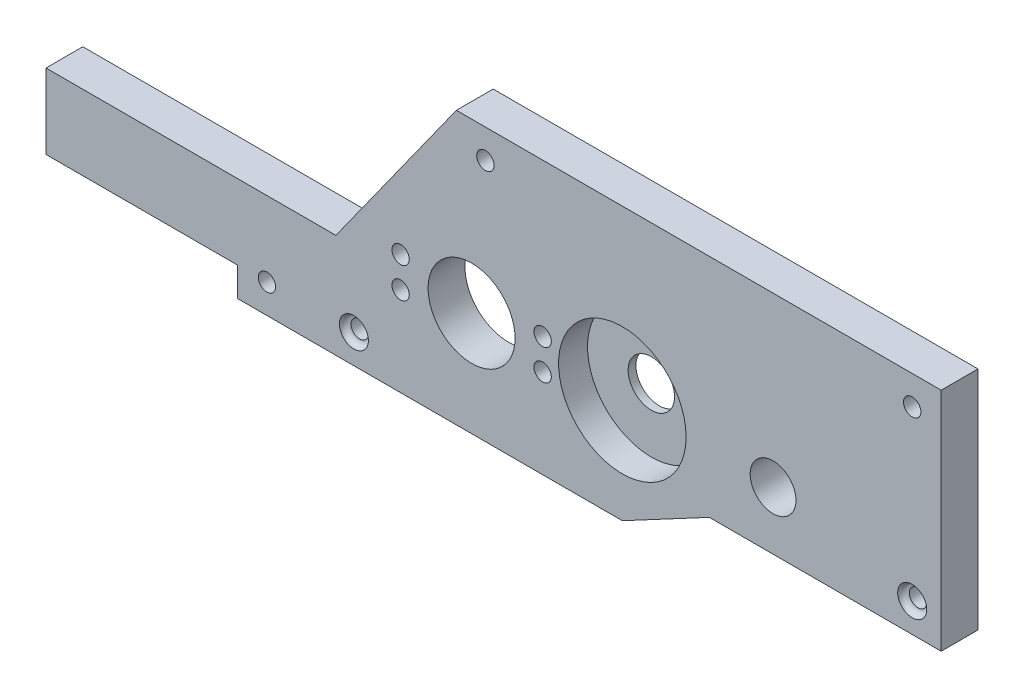
ISO-10303-21;
HEADER;
FILE_DESCRIPTION(('STEP AP214'),'2;1');
FILE_NAME('part.step','',(''),(''),'','','');
FILE_SCHEMA(('AUTOMOTIVE_DESIGN { 1 0 10303 214 1 1 1 1 }'));
ENDSEC;
DATA;
#1=APPLICATION_CONTEXT('core data for automotive mechanical design processes');
#2=APPLICATION_PROTOCOL_DEFINITION('international standard','automotive_design',2000,#1);
#3=PRODUCT_CONTEXT('',#1,'mechanical');
#4=PRODUCT('Part','Part','',(#3));
#5=PRODUCT_RELATED_PRODUCT_CATEGORY('part','',(#4));
#6=PRODUCT_DEFINITION_FORMATION('','',#4);
#7=PRODUCT_DEFINITION_CONTEXT('part definition',#1,'design');
#8=PRODUCT_DEFINITION('design','',#6,#7);
#9=PRODUCT_DEFINITION_SHAPE('','',#8);
#10=(LENGTH_UNIT() NAMED_UNIT(*) SI_UNIT(.MILLI.,.METRE.));
#11=(NAMED_UNIT(*) PLANE_ANGLE_UNIT() SI_UNIT($,.RADIAN.));
#12=(NAMED_UNIT(*) SI_UNIT($,.STERADIAN.) SOLID_ANGLE_UNIT());
#13=UNCERTAINTY_MEASURE_WITH_UNIT(LENGTH_MEASURE(1.E-05),#10,'distance_accuracy_value','');
#14=(GEOMETRIC_REPRESENTATION_CONTEXT(3) GLOBAL_UNCERTAINTY_ASSIGNED_CONTEXT((#13)) GLOBAL_UNIT_ASSIGNED_CONTEXT((#10,
#11,#12)) REPRESENTATION_CONTEXT('',''));
#15=CARTESIAN_POINT('',(0.,0.,0.));
#16=DIRECTION('',(0.,0.,1.));
#17=DIRECTION('',(1.,0.,0.));
#18=AXIS2_PLACEMENT_3D('',#15,#16,#17);
#19=CARTESIAN_POINT('',(0.,0.,6.35));
#20=DIRECTION('',(0.,0.,-1.));
#21=DIRECTION('',(-1.,0.,0.));
#22=AXIS2_PLACEMENT_3D('',#19,#20,#21);
#23=PLANE('',#22);
#24=CARTESIAN_POINT('',(6.02987029260401,-12.2207472610945,6.35));
#25=DIRECTION('',(0.,0.,-1.));
#26=DIRECTION('',(-1.,0.,0.));
#27=AXIS2_PLACEMENT_3D('',#24,#25,#26);
#28=CIRCLE('',#27,2.5);
#29=CARTESIAN_POINT('',(8.52987029260401,-12.2207472610945,6.35));
#30=VERTEX_POINT('',#29);
#31=EDGE_CURVE('E337',#30,#30,#28,.T.);
#32=ORIENTED_EDGE('',*,*,#31,.T.);
#33=EDGE_LOOP('',(#32));
#34=FACE_BOUND('',#33,.T.);
#35=CARTESIAN_POINT('',(102.331347664541,-4.22074726109447,6.35));
#36=DIRECTION('',(0.,0.,-1.));
#37=DIRECTION('',(-1.,0.,0.));
#38=AXIS2_PLACEMENT_3D('',#35,#36,#37);
#39=CIRCLE('',#38,2.5);
#40=CARTESIAN_POINT('',(104.831347664541,-4.22074726109447,6.35));
#41=VERTEX_POINT('',#40);
#42=EDGE_CURVE('E342',#41,#41,#39,.T.);
#43=ORIENTED_EDGE('',*,*,#42,.T.);
#44=EDGE_LOOP('',(#43));
#45=FACE_BOUND('',#44,.T.);
#46=CARTESIAN_POINT('',(52.331347664541,0.779252738905528,6.35));
#47=DIRECTION('',(0.,0.,1.));
#48=DIRECTION('',(1.,0.,0.));
#49=AXIS2_PLACEMENT_3D('',#46,#47,#48);
#50=CIRCLE('',#49,11.);
#51=CARTESIAN_POINT('',(63.331347664541,0.779252738905528,6.35));
#52=VERTEX_POINT('',#51);
#53=EDGE_CURVE('E349',#52,#52,#50,.T.);
#54=ORIENTED_EDGE('',*,*,#53,.F.);
#55=EDGE_LOOP('',(#54));
#56=FACE_BOUND('',#55,.T.);
#57=DIRECTION('',(-1.,0.,0.));
#58=VECTOR('',#57,1.);
#59=CARTESIAN_POINT('',(-47.0795340835919,-12.2207472610945,6.35));
#60=LINE('',#59,#58);
#61=CARTESIAN_POINT('',(-14.0795340835919,-12.2207472610945,6.35));
#62=VERTEX_POINT('',#61);
#63=CARTESIAN_POINT('',(-47.0795340835919,-12.2207472610945,6.35));
#64=VERTEX_POINT('',#63);
#65=EDGE_CURVE('E48',#62,#64,#60,.T.);
#66=ORIENTED_EDGE('',*,*,#65,.F.);
#67=DIRECTION('',(0.,1.,0.));
#68=VECTOR('',#67,1.);
#69=CARTESIAN_POINT('',(-14.0795340835919,-17.2207472610945,6.35));
#70=LINE('',#69,#68);
#71=CARTESIAN_POINT('',(-14.0795340835919,-17.2207472610945,6.35));
#72=VERTEX_POINT('',#71);
#73=EDGE_CURVE('E168',#72,#62,#70,.T.);
#74=ORIENTED_EDGE('',*,*,#73,.F.);
#75=DIRECTION('',(1.,0.,0.));
#76=VECTOR('',#75,1.);
#77=CARTESIAN_POINT('',(-47.0795340835919,-17.2207472610945,6.35));
#78=LINE('',#77,#76);
#79=CARTESIAN_POINT('',(52.3313476645411,-17.2207472610945,6.35));
#80=VERTEX_POINT('',#79);
#81=EDGE_CURVE('E174',#72,#80,#78,.T.);
#82=ORIENTED_EDGE('',*,*,#81,.T.);
#83=DIRECTION('',(0.882352941176471,0.470588235294117,0.));
#84=VECTOR('',#83,1.);
#85=CARTESIAN_POINT('',(52.3313476645411,-17.2207472610945,6.35));
#86=LINE('',#85,#84);
#87=CARTESIAN_POINT('',(67.3313476645411,-9.22074726109447,6.35));
#88=VERTEX_POINT('',#87);
#89=EDGE_CURVE('E177',#80,#88,#86,.T.);
#90=ORIENTED_EDGE('',*,*,#89,.T.);
#91=DIRECTION('',(1.,0.,0.));
#92=VECTOR('',#91,1.);
#93=CARTESIAN_POINT('',(67.3313476645411,-9.22074726109447,6.35));
#94=LINE('',#93,#92);
#95=CARTESIAN_POINT('',(107.331347664541,-9.22074726109447,6.35));
#96=VERTEX_POINT('',#95);
#97=EDGE_CURVE('E252',#88,#96,#94,.T.);
#98=ORIENTED_EDGE('',*,*,#97,.T.);
#99=DIRECTION('',(0.,1.,0.));
#100=VECTOR('',#99,1.);
#101=CARTESIAN_POINT('',(107.331347664541,29.7792527389055,6.35));
#102=LINE('',#101,#100);
#103=CARTESIAN_POINT('',(107.331347664541,29.7792527389055,6.35));
#104=VERTEX_POINT('',#103);
#105=EDGE_CURVE('E254',#96,#104,#102,.T.);
#106=ORIENTED_EDGE('',*,*,#105,.T.);
#107=DIRECTION('',(-1.,0.,0.));
#108=VECTOR('',#107,1.);
#109=CARTESIAN_POINT('',(107.331347664541,29.7792527389055,6.35));
#110=LINE('',#109,#108);
#111=CARTESIAN_POINT('',(23.7076239434154,29.7792527389055,6.35));
#112=VERTEX_POINT('',#111);
#113=EDGE_CURVE('E256',#104,#112,#110,.T.);
#114=ORIENTED_EDGE('',*,*,#113,.T.);
#115=DIRECTION('',(-0.581572960127056,-0.813494248319589,0.));
#116=VECTOR('',#115,1.);
#117=CARTESIAN_POINT('',(23.7076239434154,29.7792527389055,6.35));
#118=LINE('',#117,#116);
#119=CARTESIAN_POINT('',(2.9204659164081,0.70253381754017,6.35));
#120=VERTEX_POINT('',#119);
#121=EDGE_CURVE('E258',#112,#120,#118,.T.);
#122=ORIENTED_EDGE('',*,*,#121,.T.);
#123=DIRECTION('',(-1.,0.,0.));
#124=VECTOR('',#123,1.);
#125=CARTESIAN_POINT('',(2.9204659164081,0.70253381754017,6.35));
#126=LINE('',#125,#124);
#127=CARTESIAN_POINT('',(-47.0795340835919,0.702533817540142,6.35));
#128=VERTEX_POINT('',#127);
#129=EDGE_CURVE('E260',#120,#128,#126,.T.);
#130=ORIENTED_EDGE('',*,*,#129,.T.);
#131=DIRECTION('',(0.,-1.,0.));
#132=VECTOR('',#131,1.);
#133=CARTESIAN_POINT('',(-47.0795340835919,0.702533817540142,6.35));
#134=LINE('',#133,#132);
#135=EDGE_CURVE('E185',#128,#64,#134,.T.);
#136=ORIENTED_EDGE('',*,*,#135,.T.);
#137=EDGE_LOOP('',(#66,#74,#82,#90,#98,#106,#114,#122,#130,#136));
#138=FACE_BOUND('',#137,.T.);
#139=CARTESIAN_POINT('',(26.3313476645411,0.779252738905528,6.35));
#140=DIRECTION('',(0.,0.,1.));
#141=DIRECTION('',(1.,0.,0.));
#142=AXIS2_PLACEMENT_3D('',#139,#140,#141);
#143=CIRCLE('',#142,7.5);
#144=CARTESIAN_POINT('',(33.831347664541,0.779252738905528,6.35));
#145=VERTEX_POINT('',#144);
#146=EDGE_CURVE('E245',#145,#145,#143,.T.);
#147=ORIENTED_EDGE('',*,*,#146,.F.);
#148=EDGE_LOOP('',(#147));
#149=FACE_BOUND('',#148,.T.);
#150=CARTESIAN_POINT('',(38.581347664541,3.42925273890553,6.35));
#151=DIRECTION('',(0.,0.,1.));
#152=DIRECTION('',(1.,0.,0.));
#153=AXIS2_PLACEMENT_3D('',#150,#151,#152);
#154=CIRCLE('',#153,1.5);
#155=CARTESIAN_POINT('',(40.081347664541,3.42925273890553,6.35));
#156=VERTEX_POINT('',#155);
#157=EDGE_CURVE('E234',#156,#156,#154,.T.);
#158=ORIENTED_EDGE('',*,*,#157,.F.);
#159=EDGE_LOOP('',(#158));
#160=FACE_BOUND('',#159,.T.);
#161=CARTESIAN_POINT('',(38.581347664541,-1.87074726109447,6.35));
#162=DIRECTION('',(0.,0.,1.));
#163=DIRECTION('',(-1.,0.,0.));
#164=AXIS2_PLACEMENT_3D('',#161,#162,#163);
#165=CIRCLE('',#164,1.5);
#166=CARTESIAN_POINT('',(37.0813476645411,-1.87074726109447,6.35));
#167=VERTEX_POINT('',#166);
#168=EDGE_CURVE('E232',#167,#167,#165,.T.);
#169=ORIENTED_EDGE('',*,*,#168,.F.);
#170=EDGE_LOOP('',(#169));
#171=FACE_BOUND('',#170,.T.);
#172=CARTESIAN_POINT('',(14.0813476645411,-1.87074726109447,6.35));
#173=DIRECTION('',(0.,0.,1.));
#174=DIRECTION('',(1.,0.,0.));
#175=AXIS2_PLACEMENT_3D('',#172,#173,#174);
#176=CIRCLE('',#175,1.5);
#177=CARTESIAN_POINT('',(15.5813476645411,-1.87074726109447,6.35));
#178=VERTEX_POINT('',#177);
#179=EDGE_CURVE('E235',#178,#178,#176,.T.);
#180=ORIENTED_EDGE('',*,*,#179,.F.);
#181=EDGE_LOOP('',(#180));
#182=FACE_BOUND('',#181,.T.);
#183=CARTESIAN_POINT('',(14.0813476645411,3.42925273890553,6.35));
#184=DIRECTION('',(0.,0.,1.));
#185=DIRECTION('',(-1.,0.,0.));
#186=AXIS2_PLACEMENT_3D('',#183,#184,#185);
#187=CIRCLE('',#186,1.5);
#188=CARTESIAN_POINT('',(12.5813476645411,3.42925273890553,6.35));
#189=VERTEX_POINT('',#188);
#190=EDGE_CURVE('E241',#189,#189,#187,.T.);
#191=ORIENTED_EDGE('',*,*,#190,.F.);
#192=EDGE_LOOP('',(#191));
#193=FACE_BOUND('',#192,.T.);
#194=CARTESIAN_POINT('',(78.3313476645411,0.779252738905528,6.35));
#195=DIRECTION('',(0.,0.,1.));
#196=DIRECTION('',(1.,0.,0.));
#197=AXIS2_PLACEMENT_3D('',#194,#195,#196);
#198=CIRCLE('',#197,3.95);
#199=CARTESIAN_POINT('',(82.2813476645411,0.779252738905528,6.35));
#200=VERTEX_POINT('',#199);
#201=EDGE_CURVE('E379',#200,#200,#198,.T.);
#202=ORIENTED_EDGE('',*,*,#201,.F.);
#203=EDGE_LOOP('',(#202));
#204=FACE_BOUND('',#203,.T.);
#205=CARTESIAN_POINT('',(-8.97012970739599,-12.2207472610945,6.35));
#206=DIRECTION('',(0.,0.,1.));
#207=DIRECTION('',(1.,0.,0.));
#208=AXIS2_PLACEMENT_3D('',#205,#206,#207);
#209=CIRCLE('',#208,1.5);
#210=CARTESIAN_POINT('',(-7.47012970739599,-12.2207472610945,6.35));
#211=VERTEX_POINT('',#210);
#212=EDGE_CURVE('E373',#211,#211,#209,.T.);
#213=ORIENTED_EDGE('',*,*,#212,.F.);
#214=EDGE_LOOP('',(#213));
#215=FACE_BOUND('',#214,.T.);
#216=CARTESIAN_POINT('',(28.7076239434154,24.7792527389055,6.35));
#217=DIRECTION('',(0.,0.,1.));
#218=DIRECTION('',(1.,0.,0.));
#219=AXIS2_PLACEMENT_3D('',#216,#217,#218);
#220=CIRCLE('',#219,1.5);
#221=CARTESIAN_POINT('',(30.2076239434154,24.7792527389055,6.35));
#222=VERTEX_POINT('',#221);
#223=EDGE_CURVE('E364',#222,#222,#220,.T.);
#224=ORIENTED_EDGE('',*,*,#223,.F.);
#225=EDGE_LOOP('',(#224));
#226=FACE_BOUND('',#225,.T.);
#227=CARTESIAN_POINT('',(102.331347664541,24.7792527389055,6.35));
#228=DIRECTION('',(0.,0.,1.));
#229=DIRECTION('',(1.,0.,0.));
#230=AXIS2_PLACEMENT_3D('',#227,#228,#229);
#231=CIRCLE('',#230,1.5);
#232=CARTESIAN_POINT('',(103.831347664541,24.7792527389055,6.35));
#233=VERTEX_POINT('',#232);
#234=EDGE_CURVE('E361',#233,#233,#231,.T.);
#235=ORIENTED_EDGE('',*,*,#234,.F.);
#236=EDGE_LOOP('',(#235));
#237=FACE_BOUND('',#236,.T.);
#238=ADVANCED_FACE('F33',(#34,#45,#56,#138,#149,#160,#171,#182,#193,#204,#215,#226,#237),#23,.F.);
#239=CARTESIAN_POINT('',(0.,0.,0.));
#240=DIRECTION('',(0.,0.,-1.));
#241=DIRECTION('',(-1.,0.,0.));
#242=AXIS2_PLACEMENT_3D('',#239,#240,#241);
#243=PLANE('',#242);
#244=DIRECTION('',(0.,-1.,0.));
#245=VECTOR('',#244,1.);
#246=CARTESIAN_POINT('',(-14.0795340835919,-17.2207472610945,0.));
#247=LINE('',#246,#245);
#248=CARTESIAN_POINT('',(-14.0795340835919,-12.2207472610945,0.));
#249=VERTEX_POINT('',#248);
#250=CARTESIAN_POINT('',(-14.0795340835919,-17.2207472610945,0.));
#251=VERTEX_POINT('',#250);
#252=EDGE_CURVE('E159',#249,#251,#247,.T.);
#253=ORIENTED_EDGE('',*,*,#252,.F.);
#254=DIRECTION('',(1.,0.,0.));
#255=VECTOR('',#254,1.);
#256=CARTESIAN_POINT('',(-47.0795340835919,-12.2207472610945,0.));
#257=LINE('',#256,#255);
#258=CARTESIAN_POINT('',(-47.0795340835919,-12.2207472610945,0.));
#259=VERTEX_POINT('',#258);
#260=EDGE_CURVE('E152',#259,#249,#257,.T.);
#261=ORIENTED_EDGE('',*,*,#260,.F.);
#262=DIRECTION('',(0.,-1.,0.));
#263=VECTOR('',#262,1.);
#264=CARTESIAN_POINT('',(-47.0795340835919,0.702533817540142,0.));
#265=LINE('',#264,#263);
#266=CARTESIAN_POINT('',(-47.0795340835919,0.702533817540142,0.));
#267=VERTEX_POINT('',#266);
#268=EDGE_CURVE('E166',#267,#259,#265,.T.);
#269=ORIENTED_EDGE('',*,*,#268,.F.);
#270=DIRECTION('',(-1.,0.,0.));
#271=VECTOR('',#270,1.);
#272=CARTESIAN_POINT('',(2.9204659164081,0.70253381754017,0.));
#273=LINE('',#272,#271);
#274=CARTESIAN_POINT('',(2.9204659164081,0.70253381754017,0.));
#275=VERTEX_POINT('',#274);
#276=EDGE_CURVE('E175',#275,#267,#273,.T.);
#277=ORIENTED_EDGE('',*,*,#276,.F.);
#278=DIRECTION('',(-0.581572960127056,-0.813494248319589,0.));
#279=VECTOR('',#278,1.);
#280=CARTESIAN_POINT('',(23.7076239434154,29.7792527389055,0.));
#281=LINE('',#280,#279);
#282=CARTESIAN_POINT('',(23.7076239434154,29.7792527389055,0.));
#283=VERTEX_POINT('',#282);
#284=EDGE_CURVE('E179',#283,#275,#281,.T.);
#285=ORIENTED_EDGE('',*,*,#284,.F.);
#286=DIRECTION('',(-1.,0.,0.));
#287=VECTOR('',#286,1.);
#288=CARTESIAN_POINT('',(107.331347664541,29.7792527389055,0.));
#289=LINE('',#288,#287);
#290=CARTESIAN_POINT('',(107.331347664541,29.7792527389055,0.));
#291=VERTEX_POINT('',#290);
#292=EDGE_CURVE('E270',#291,#283,#289,.T.);
#293=ORIENTED_EDGE('',*,*,#292,.F.);
#294=DIRECTION('',(0.,1.,0.));
#295=VECTOR('',#294,1.);
#296=CARTESIAN_POINT('',(107.331347664541,29.7792527389055,0.));
#297=LINE('',#296,#295);
#298=CARTESIAN_POINT('',(107.331347664541,-9.22074726109447,0.));
#299=VERTEX_POINT('',#298);
#300=EDGE_CURVE('E268',#299,#291,#297,.T.);
#301=ORIENTED_EDGE('',*,*,#300,.F.);
#302=DIRECTION('',(1.,0.,0.));
#303=VECTOR('',#302,1.);
#304=CARTESIAN_POINT('',(67.3313476645411,-9.22074726109447,0.));
#305=LINE('',#304,#303);
#306=CARTESIAN_POINT('',(67.3313476645411,-9.22074726109447,0.));
#307=VERTEX_POINT('',#306);
#308=EDGE_CURVE('E266',#307,#299,#305,.T.);
#309=ORIENTED_EDGE('',*,*,#308,.F.);
#310=DIRECTION('',(0.882352941176471,0.470588235294117,0.));
#311=VECTOR('',#310,1.);
#312=CARTESIAN_POINT('',(52.3313476645411,-17.2207472610945,0.));
#313=LINE('',#312,#311);
#314=CARTESIAN_POINT('',(52.3313476645411,-17.2207472610945,0.));
#315=VERTEX_POINT('',#314);
#316=EDGE_CURVE('E264',#315,#307,#313,.T.);
#317=ORIENTED_EDGE('',*,*,#316,.F.);
#318=DIRECTION('',(1.,0.,0.));
#319=VECTOR('',#318,1.);
#320=CARTESIAN_POINT('',(26.3313476645411,-17.2207472610945,0.));
#321=LINE('',#320,#319);
#322=EDGE_CURVE('E248',#251,#315,#321,.T.);
#323=ORIENTED_EDGE('',*,*,#322,.F.);
#324=EDGE_LOOP('',(#253,#261,#269,#277,#285,#293,#301,#309,#317,#323));
#325=FACE_BOUND('',#324,.T.);
#326=CARTESIAN_POINT('',(28.7076239434154,24.7792527389055,0.));
#327=DIRECTION('',(0.,0.,-1.));
#328=DIRECTION('',(-1.,0.,0.));
#329=AXIS2_PLACEMENT_3D('',#326,#327,#328);
#330=CIRCLE('',#329,2.5);
#331=CARTESIAN_POINT('',(31.2076239434154,24.7792527389055,0.));
#332=VERTEX_POINT('',#331);
#333=EDGE_CURVE('E315',#332,#332,#330,.T.);
#334=ORIENTED_EDGE('',*,*,#333,.F.);
#335=EDGE_LOOP('',(#334));
#336=FACE_BOUND('',#335,.T.);
#337=CARTESIAN_POINT('',(38.581347664541,-1.87074726109447,0.));
#338=DIRECTION('',(0.,0.,-1.));
#339=DIRECTION('',(-1.,0.,0.));
#340=AXIS2_PLACEMENT_3D('',#337,#338,#339);
#341=CIRCLE('',#340,2.5);
#342=CARTESIAN_POINT('',(36.0813476645411,-1.87074726109447,0.));
#343=VERTEX_POINT('',#342);
#344=EDGE_CURVE('E318',#343,#343,#341,.T.);
#345=ORIENTED_EDGE('',*,*,#344,.F.);
#346=EDGE_LOOP('',(#345));
#347=FACE_BOUND('',#346,.T.);
#348=CARTESIAN_POINT('',(38.581347664541,3.42925273890553,0.));
#349=DIRECTION('',(0.,0.,-1.));
#350=DIRECTION('',(-1.,0.,0.));
#351=AXIS2_PLACEMENT_3D('',#348,#349,#350);
#352=CIRCLE('',#351,2.5);
#353=CARTESIAN_POINT('',(41.081347664541,3.42925273890553,0.));
#354=VERTEX_POINT('',#353);
#355=EDGE_CURVE('E322',#354,#354,#352,.T.);
#356=ORIENTED_EDGE('',*,*,#355,.F.);
#357=EDGE_LOOP('',(#356));
#358=FACE_BOUND('',#357,.T.);
#359=CARTESIAN_POINT('',(14.0813476645411,-1.87074726109447,0.));
#360=DIRECTION('',(0.,0.,-1.));
#361=DIRECTION('',(-1.,0.,0.));
#362=AXIS2_PLACEMENT_3D('',#359,#360,#361);
#363=CIRCLE('',#362,2.5);
#364=CARTESIAN_POINT('',(16.5813476645411,-1.87074726109447,0.));
#365=VERTEX_POINT('',#364);
#366=EDGE_CURVE('E327',#365,#365,#363,.T.);
#367=ORIENTED_EDGE('',*,*,#366,.F.);
#368=EDGE_LOOP('',(#367));
#369=FACE_BOUND('',#368,.T.);
#370=CARTESIAN_POINT('',(14.0813476645411,3.42925273890553,0.));
#371=DIRECTION('',(0.,0.,-1.));
#372=DIRECTION('',(-1.,0.,0.));
#373=AXIS2_PLACEMENT_3D('',#370,#371,#372);
#374=CIRCLE('',#373,2.5);
#375=CARTESIAN_POINT('',(11.581347664541,3.42925273890553,0.));
#376=VERTEX_POINT('',#375);
#377=EDGE_CURVE('E332',#376,#376,#374,.T.);
#378=ORIENTED_EDGE('',*,*,#377,.F.);
#379=EDGE_LOOP('',(#378));
#380=FACE_BOUND('',#379,.T.);
#381=CARTESIAN_POINT('',(52.331347664541,0.779252738905528,0.));
#382=DIRECTION('',(0.,0.,-1.));
#383=DIRECTION('',(-1.,0.,0.));
#384=AXIS2_PLACEMENT_3D('',#381,#382,#383);
#385=CIRCLE('',#384,4.00000000000001);
#386=CARTESIAN_POINT('',(48.331347664541,0.779252738905528,0.));
#387=VERTEX_POINT('',#386);
#388=EDGE_CURVE('E345',#387,#387,#385,.F.);
#389=ORIENTED_EDGE('',*,*,#388,.T.);
#390=EDGE_LOOP('',(#389));
#391=FACE_BOUND('',#390,.T.);
#392=CARTESIAN_POINT('',(102.331347664541,24.7792527389055,0.));
#393=DIRECTION('',(0.,0.,1.));
#394=DIRECTION('',(1.,0.,0.));
#395=AXIS2_PLACEMENT_3D('',#392,#393,#394);
#396=CIRCLE('',#395,1.5);
#397=CARTESIAN_POINT('',(103.831347664541,24.7792527389055,0.));
#398=VERTEX_POINT('',#397);
#399=EDGE_CURVE('E360',#398,#398,#396,.T.);
#400=ORIENTED_EDGE('',*,*,#399,.T.);
#401=EDGE_LOOP('',(#400));
#402=FACE_BOUND('',#401,.T.);
#403=CARTESIAN_POINT('',(6.02987029260401,-12.2207472610945,0.));
#404=DIRECTION('',(0.,0.,1.));
#405=DIRECTION('',(1.,0.,0.));
#406=AXIS2_PLACEMENT_3D('',#403,#404,#405);
#407=CIRCLE('',#406,1.5);
#408=CARTESIAN_POINT('',(7.52987029260401,-12.2207472610945,0.));
#409=VERTEX_POINT('',#408);
#410=EDGE_CURVE('E369',#409,#409,#407,.T.);
#411=ORIENTED_EDGE('',*,*,#410,.T.);
#412=EDGE_LOOP('',(#411));
#413=FACE_BOUND('',#412,.T.);
#414=CARTESIAN_POINT('',(78.3313476645411,0.779252738905528,0.));
#415=DIRECTION('',(0.,0.,1.));
#416=DIRECTION('',(1.,0.,0.));
#417=AXIS2_PLACEMENT_3D('',#414,#415,#416);
#418=CIRCLE('',#417,3.95);
#419=CARTESIAN_POINT('',(82.2813476645411,0.779252738905528,0.));
#420=VERTEX_POINT('',#419);
#421=EDGE_CURVE('E376',#420,#420,#418,.T.);
#422=ORIENTED_EDGE('',*,*,#421,.T.);
#423=EDGE_LOOP('',(#422));
#424=FACE_BOUND('',#423,.T.);
#425=CARTESIAN_POINT('',(26.3313476645411,0.779252738905528,0.));
#426=DIRECTION('',(0.,0.,1.));
#427=DIRECTION('',(1.,0.,0.));
#428=AXIS2_PLACEMENT_3D('',#425,#426,#427);
#429=CIRCLE('',#428,7.5);
#430=CARTESIAN_POINT('',(33.831347664541,0.779252738905528,0.));
#431=VERTEX_POINT('',#430);
#432=EDGE_CURVE('E238',#431,#431,#429,.T.);
#433=ORIENTED_EDGE('',*,*,#432,.T.);
#434=EDGE_LOOP('',(#433));
#435=FACE_BOUND('',#434,.T.);
#436=CARTESIAN_POINT('',(-8.97012970739599,-12.2207472610945,0.));
#437=DIRECTION('',(0.,0.,1.));
#438=DIRECTION('',(1.,0.,0.));
#439=AXIS2_PLACEMENT_3D('',#436,#437,#438);
#440=CIRCLE('',#439,1.5);
#441=CARTESIAN_POINT('',(-7.47012970739599,-12.2207472610945,0.));
#442=VERTEX_POINT('',#441);
#443=EDGE_CURVE('E372',#442,#442,#440,.T.);
#444=ORIENTED_EDGE('',*,*,#443,.T.);
#445=EDGE_LOOP('',(#444));
#446=FACE_BOUND('',#445,.T.);
#447=CARTESIAN_POINT('',(102.331347664541,-4.22074726109447,0.));
#448=DIRECTION('',(0.,0.,1.));
#449=DIRECTION('',(1.,0.,0.));
#450=AXIS2_PLACEMENT_3D('',#447,#448,#449);
#451=CIRCLE('',#450,1.5);
#452=CARTESIAN_POINT('',(103.831347664541,-4.22074726109447,0.));
#453=VERTEX_POINT('',#452);
#454=EDGE_CURVE('E355',#453,#453,#451,.T.);
#455=ORIENTED_EDGE('',*,*,#454,.T.);
#456=EDGE_LOOP('',(#455));
#457=FACE_BOUND('',#456,.T.);
#458=ADVANCED_FACE('F163',(#325,#336,#347,#358,#369,#380,#391,#402,#413,#424,#435,#446,#457),
#243,.T.);
#459=CARTESIAN_POINT('',(26.3313476645411,-17.2207472610945,6.35));
#460=DIRECTION('',(0.,1.,0.));
#461=DIRECTION('',(-1.,0.,0.));
#462=AXIS2_PLACEMENT_3D('',#459,#460,#461);
#463=PLANE('',#462);
#464=ORIENTED_EDGE('',*,*,#81,.F.);
#465=DIRECTION('',(0.,0.,-1.));
#466=VECTOR('',#465,1.);
#467=CARTESIAN_POINT('',(-14.0795340835919,-17.2207472610945,6.351));
#468=LINE('',#467,#466);
#469=EDGE_CURVE('E305',#72,#251,#468,.T.);
#470=ORIENTED_EDGE('',*,*,#469,.T.);
#471=ORIENTED_EDGE('',*,*,#322,.T.);
#472=DIRECTION('',(0.,0.,-1.));
#473=VECTOR('',#472,1.);
#474=CARTESIAN_POINT('',(52.3313476645411,-17.2207472610945,6.35));
#475=LINE('',#474,#473);
#476=EDGE_CURVE('E200',#80,#315,#475,.T.);
#477=ORIENTED_EDGE('',*,*,#476,.F.);
#478=EDGE_LOOP('',(#464,#470,#471,#477));
#479=FACE_BOUND('',#478,.T.);
#480=ADVANCED_FACE('F35',(#479),#463,.F.);
#481=CARTESIAN_POINT('',(52.3313476645411,-17.2207472610945,6.35));
#482=DIRECTION('',(-0.470588235294117,0.882352941176471,0.));
#483=DIRECTION('',(-0.882352941176471,-0.470588235294117,0.));
#484=AXIS2_PLACEMENT_3D('',#481,#482,#483);
#485=PLANE('',#484);
#486=ORIENTED_EDGE('',*,*,#316,.T.);
#487=DIRECTION('',(0.,0.,-1.));
#488=VECTOR('',#487,1.);
#489=CARTESIAN_POINT('',(67.3313476645411,-9.22074726109447,6.35));
#490=LINE('',#489,#488);
#491=EDGE_CURVE('E197',#88,#307,#490,.T.);
#492=ORIENTED_EDGE('',*,*,#491,.F.);
#493=ORIENTED_EDGE('',*,*,#89,.F.);
#494=ORIENTED_EDGE('',*,*,#476,.T.);
#495=EDGE_LOOP('',(#486,#492,#493,#494));
#496=FACE_BOUND('',#495,.T.);
#497=ADVANCED_FACE('F300',(#496),#485,.F.);
#498=CARTESIAN_POINT('',(67.3313476645411,-9.22074726109447,6.35));
#499=DIRECTION('',(0.,1.,0.));
#500=DIRECTION('',(0.,0.,1.));
#501=AXIS2_PLACEMENT_3D('',#498,#499,#500);
#502=PLANE('',#501);
#503=ORIENTED_EDGE('',*,*,#308,.T.);
#504=DIRECTION('',(0.,0.,-1.));
#505=VECTOR('',#504,1.);
#506=CARTESIAN_POINT('',(107.331347664541,-9.22074726109447,6.35));
#507=LINE('',#506,#505);
#508=EDGE_CURVE('E194',#96,#299,#507,.T.);
#509=ORIENTED_EDGE('',*,*,#508,.F.);
#510=ORIENTED_EDGE('',*,*,#97,.F.);
#511=ORIENTED_EDGE('',*,*,#491,.T.);
#512=EDGE_LOOP('',(#503,#509,#510,#511));
#513=FACE_BOUND('',#512,.T.);
#514=ADVANCED_FACE('F296',(#513),#502,.F.);
#515=CARTESIAN_POINT('',(107.331347664541,29.7792527389055,6.35));
#516=DIRECTION('',(-1.,0.,0.));
#517=DIRECTION('',(0.,-1.,0.));
#518=AXIS2_PLACEMENT_3D('',#515,#516,#517);
#519=PLANE('',#518);
#520=ORIENTED_EDGE('',*,*,#300,.T.);
#521=DIRECTION('',(0.,0.,-1.));
#522=VECTOR('',#521,1.);
#523=CARTESIAN_POINT('',(107.331347664541,29.7792527389055,6.35));
#524=LINE('',#523,#522);
#525=EDGE_CURVE('E191',#104,#291,#524,.T.);
#526=ORIENTED_EDGE('',*,*,#525,.F.);
#527=ORIENTED_EDGE('',*,*,#105,.F.);
#528=ORIENTED_EDGE('',*,*,#508,.T.);
#529=EDGE_LOOP('',(#520,#526,#527,#528));
#530=FACE_BOUND('',#529,.T.);
#531=ADVANCED_FACE('F292',(#530),#519,.F.);
#532=CARTESIAN_POINT('',(107.331347664541,29.7792527389055,6.35));
#533=DIRECTION('',(0.,-1.,0.));
#534=DIRECTION('',(1.,0.,0.));
#535=AXIS2_PLACEMENT_3D('',#532,#533,#534);
#536=PLANE('',#535);
#537=ORIENTED_EDGE('',*,*,#292,.T.);
#538=DIRECTION('',(0.,0.,-1.));
#539=VECTOR('',#538,1.);
#540=CARTESIAN_POINT('',(23.7076239434154,29.7792527389055,6.35));
#541=LINE('',#540,#539);
#542=EDGE_CURVE('E188',#112,#283,#541,.T.);
#543=ORIENTED_EDGE('',*,*,#542,.F.);
#544=ORIENTED_EDGE('',*,*,#113,.F.);
#545=ORIENTED_EDGE('',*,*,#525,.T.);
#546=EDGE_LOOP('',(#537,#543,#544,#545));
#547=FACE_BOUND('',#546,.T.);
#548=ADVANCED_FACE('F287',(#547),#536,.F.);
#549=CARTESIAN_POINT('',(23.7076239434154,29.7792527389055,6.35));
#550=DIRECTION('',(0.813494248319589,-0.581572960127056,0.));
#551=DIRECTION('',(0.581572960127056,0.81349424831959,0.));
#552=AXIS2_PLACEMENT_3D('',#549,#550,#551);
#553=PLANE('',#552);
#554=ORIENTED_EDGE('',*,*,#284,.T.);
#555=DIRECTION('',(0.,0.,-1.));
#556=VECTOR('',#555,1.);
#557=CARTESIAN_POINT('',(2.9204659164081,0.70253381754017,6.35));
#558=LINE('',#557,#556);
#559=EDGE_CURVE('E184',#120,#275,#558,.T.);
#560=ORIENTED_EDGE('',*,*,#559,.F.);
#561=ORIENTED_EDGE('',*,*,#121,.F.);
#562=ORIENTED_EDGE('',*,*,#542,.T.);
#563=EDGE_LOOP('',(#554,#560,#561,#562));
#564=FACE_BOUND('',#563,.T.);
#565=ADVANCED_FACE('F274',(#564),#553,.F.);
#566=CARTESIAN_POINT('',(2.9204659164081,0.70253381754017,6.35));
#567=DIRECTION('',(0.,-1.,0.));
#568=DIRECTION('',(1.,0.,0.));
#569=AXIS2_PLACEMENT_3D('',#566,#567,#568);
#570=PLANE('',#569);
#571=ORIENTED_EDGE('',*,*,#276,.T.);
#572=DIRECTION('',(0.,0.,-1.));
#573=VECTOR('',#572,1.);
#574=CARTESIAN_POINT('',(-47.0795340835919,0.702533817540142,6.35));
#575=LINE('',#574,#573);
#576=EDGE_CURVE('E173',#128,#267,#575,.T.);
#577=ORIENTED_EDGE('',*,*,#576,.F.);
#578=ORIENTED_EDGE('',*,*,#129,.F.);
#579=ORIENTED_EDGE('',*,*,#559,.T.);
#580=EDGE_LOOP('',(#571,#577,#578,#579));
#581=FACE_BOUND('',#580,.T.);
#582=ADVANCED_FACE('F280',(#581),#570,.F.);
#583=CARTESIAN_POINT('',(-47.0795340835919,0.702533817540142,6.35));
#584=DIRECTION('',(1.,0.,0.));
#585=DIRECTION('',(0.,0.,-1.));
#586=AXIS2_PLACEMENT_3D('',#583,#584,#585);
#587=PLANE('',#586);
#588=ORIENTED_EDGE('',*,*,#268,.T.);
#589=DIRECTION('',(0.,0.,-1.));
#590=VECTOR('',#589,1.);
#591=CARTESIAN_POINT('',(-47.0795340835919,-12.2207472610945,6.351));
#592=LINE('',#591,#590);
#593=EDGE_CURVE('E149',#64,#259,#592,.T.);
#594=ORIENTED_EDGE('',*,*,#593,.F.);
#595=ORIENTED_EDGE('',*,*,#135,.F.);
#596=ORIENTED_EDGE('',*,*,#576,.T.);
#597=EDGE_LOOP('',(#588,#594,#595,#596));
#598=FACE_BOUND('',#597,.T.);
#599=ADVANCED_FACE('F171',(#598),#587,.F.);
#600=CARTESIAN_POINT('',(26.3313476645411,0.779252738905528,6.35));
#601=DIRECTION('',(0.,0.,-1.));
#602=DIRECTION('',(-1.,0.,0.));
#603=AXIS2_PLACEMENT_3D('',#600,#601,#602);
#604=CYLINDRICAL_SURFACE('',#603,7.5);
#605=ORIENTED_EDGE('',*,*,#146,.T.);
#606=EDGE_LOOP('',(#605));
#607=FACE_BOUND('',#606,.T.);
#608=ORIENTED_EDGE('',*,*,#432,.F.);
#609=EDGE_LOOP('',(#608));
#610=FACE_BOUND('',#609,.T.);
#611=ADVANCED_FACE('F457',(#607,#610),#604,.F.);
#612=CARTESIAN_POINT('',(38.581347664541,3.42925273890553,6.35));
#613=DIRECTION('',(0.,0.,-1.));
#614=DIRECTION('',(-1.,0.,0.));
#615=AXIS2_PLACEMENT_3D('',#612,#613,#614);
#616=CYLINDRICAL_SURFACE('',#615,1.5);
#617=CARTESIAN_POINT('',(38.581347664541,3.42925273890553,1.));
#618=DIRECTION('',(0.,0.,-1.));
#619=DIRECTION('',(-1.,0.,0.));
#620=AXIS2_PLACEMENT_3D('',#617,#618,#619);
#621=CIRCLE('',#620,1.5);
#622=CARTESIAN_POINT('',(40.081347664541,3.42925273890553,1.));
#623=VERTEX_POINT('',#622);
#624=EDGE_CURVE('E215',#623,#623,#621,.F.);
#625=ORIENTED_EDGE('',*,*,#624,.F.);
#626=EDGE_LOOP('',(#625));
#627=FACE_BOUND('',#626,.T.);
#628=ORIENTED_EDGE('',*,*,#157,.T.);
#629=EDGE_LOOP('',(#628));
#630=FACE_BOUND('',#629,.T.);
#631=ADVANCED_FACE('F228',(#627,#630),#616,.F.);
#632=CARTESIAN_POINT('',(38.581347664541,-1.87074726109447,6.35));
#633=DIRECTION('',(0.,0.,-1.));
#634=DIRECTION('',(-1.,0.,0.));
#635=AXIS2_PLACEMENT_3D('',#632,#633,#634);
#636=CYLINDRICAL_SURFACE('',#635,1.5);
#637=CARTESIAN_POINT('',(38.581347664541,-1.87074726109447,1.));
#638=DIRECTION('',(0.,0.,-1.));
#639=DIRECTION('',(-1.,0.,0.));
#640=AXIS2_PLACEMENT_3D('',#637,#638,#639);
#641=CIRCLE('',#640,1.5);
#642=CARTESIAN_POINT('',(37.0813476645411,-1.87074726109447,1.));
#643=VERTEX_POINT('',#642);
#644=EDGE_CURVE('E41',#643,#643,#641,.F.);
#645=ORIENTED_EDGE('',*,*,#644,.F.);
#646=EDGE_LOOP('',(#645));
#647=FACE_BOUND('',#646,.T.);
#648=ORIENTED_EDGE('',*,*,#168,.T.);
#649=EDGE_LOOP('',(#648));
#650=FACE_BOUND('',#649,.T.);
#651=ADVANCED_FACE('F224',(#647,#650),#636,.F.);
#652=CARTESIAN_POINT('',(14.0813476645411,-1.87074726109447,6.35));
#653=DIRECTION('',(0.,0.,-1.));
#654=DIRECTION('',(-1.,0.,0.));
#655=AXIS2_PLACEMENT_3D('',#652,#653,#654);
#656=CYLINDRICAL_SURFACE('',#655,1.5);
#657=CARTESIAN_POINT('',(14.0813476645411,-1.87074726109447,1.));
#658=DIRECTION('',(0.,0.,-1.));
#659=DIRECTION('',(-1.,0.,0.));
#660=AXIS2_PLACEMENT_3D('',#657,#658,#659);
#661=CIRCLE('',#660,1.5);
#662=CARTESIAN_POINT('',(15.5813476645411,-1.87074726109447,1.));
#663=VERTEX_POINT('',#662);
#664=EDGE_CURVE('E212',#663,#663,#661,.F.);
#665=ORIENTED_EDGE('',*,*,#664,.F.);
#666=EDGE_LOOP('',(#665));
#667=FACE_BOUND('',#666,.T.);
#668=ORIENTED_EDGE('',*,*,#179,.T.);
#669=EDGE_LOOP('',(#668));
#670=FACE_BOUND('',#669,.T.);
#671=ADVANCED_FACE('F227',(#667,#670),#656,.F.);
#672=CARTESIAN_POINT('',(14.0813476645411,3.42925273890553,6.35));
#673=DIRECTION('',(0.,0.,-1.));
#674=DIRECTION('',(-1.,0.,0.));
#675=AXIS2_PLACEMENT_3D('',#672,#673,#674);
#676=CYLINDRICAL_SURFACE('',#675,1.5);
#677=CARTESIAN_POINT('',(14.0813476645411,3.42925273890553,1.));
#678=DIRECTION('',(0.,0.,-1.));
#679=DIRECTION('',(-1.,0.,0.));
#680=AXIS2_PLACEMENT_3D('',#677,#678,#679);
#681=CIRCLE('',#680,1.5);
#682=CARTESIAN_POINT('',(12.5813476645411,3.42925273890553,1.));
#683=VERTEX_POINT('',#682);
#684=EDGE_CURVE('E209',#683,#683,#681,.F.);
#685=ORIENTED_EDGE('',*,*,#684,.F.);
#686=EDGE_LOOP('',(#685));
#687=FACE_BOUND('',#686,.T.);
#688=ORIENTED_EDGE('',*,*,#190,.T.);
#689=EDGE_LOOP('',(#688));
#690=FACE_BOUND('',#689,.T.);
#691=ADVANCED_FACE('F386',(#687,#690),#676,.F.);
#692=CARTESIAN_POINT('',(78.3313476645411,0.779252738905528,6.35));
#693=DIRECTION('',(0.,0.,-1.));
#694=DIRECTION('',(-1.,0.,0.));
#695=AXIS2_PLACEMENT_3D('',#692,#693,#694);
#696=CYLINDRICAL_SURFACE('',#695,3.95);
#697=ORIENTED_EDGE('',*,*,#201,.T.);
#698=EDGE_LOOP('',(#697));
#699=FACE_BOUND('',#698,.T.);
#700=ORIENTED_EDGE('',*,*,#421,.F.);
#701=EDGE_LOOP('',(#700));
#702=FACE_BOUND('',#701,.T.);
#703=ADVANCED_FACE('F444',(#699,#702),#696,.F.);
#704=CARTESIAN_POINT('',(-8.97012970739599,-12.2207472610945,6.35));
#705=DIRECTION('',(0.,0.,-1.));
#706=DIRECTION('',(-1.,0.,0.));
#707=AXIS2_PLACEMENT_3D('',#704,#705,#706);
#708=CYLINDRICAL_SURFACE('',#707,1.5);
#709=ORIENTED_EDGE('',*,*,#212,.T.);
#710=EDGE_LOOP('',(#709));
#711=FACE_BOUND('',#710,.T.);
#712=ORIENTED_EDGE('',*,*,#443,.F.);
#713=EDGE_LOOP('',(#712));
#714=FACE_BOUND('',#713,.T.);
#715=ADVANCED_FACE('F440',(#711,#714),#708,.F.);
#716=CARTESIAN_POINT('',(6.02987029260401,-12.2207472610945,6.35));
#717=DIRECTION('',(0.,0.,-1.));
#718=DIRECTION('',(-1.,0.,0.));
#719=AXIS2_PLACEMENT_3D('',#716,#717,#718);
#720=CYLINDRICAL_SURFACE('',#719,1.5);
#721=CARTESIAN_POINT('',(6.02987029260401,-12.2207472610945,5.35));
#722=DIRECTION('',(0.,0.,1.));
#723=DIRECTION('',(1.,0.,0.));
#724=AXIS2_PLACEMENT_3D('',#721,#722,#723);
#725=CIRCLE('',#724,1.5);
#726=CARTESIAN_POINT('',(7.52987029260401,-12.2207472610945,5.35));
#727=VERTEX_POINT('',#726);
#728=EDGE_CURVE('E206',#727,#727,#725,.F.);
#729=ORIENTED_EDGE('',*,*,#728,.F.);
#730=EDGE_LOOP('',(#729));
#731=FACE_BOUND('',#730,.T.);
#732=ORIENTED_EDGE('',*,*,#410,.F.);
#733=EDGE_LOOP('',(#732));
#734=FACE_BOUND('',#733,.T.);
#735=ADVANCED_FACE('F436',(#731,#734),#720,.F.);
#736=CARTESIAN_POINT('',(28.7076239434154,24.7792527389055,6.35));
#737=DIRECTION('',(0.,0.,-1.));
#738=DIRECTION('',(-1.,0.,0.));
#739=AXIS2_PLACEMENT_3D('',#736,#737,#738);
#740=CYLINDRICAL_SURFACE('',#739,1.5);
#741=CARTESIAN_POINT('',(28.7076239434154,24.7792527389055,1.));
#742=DIRECTION('',(0.,0.,-1.));
#743=DIRECTION('',(-1.,0.,0.));
#744=AXIS2_PLACEMENT_3D('',#741,#742,#743);
#745=CIRCLE('',#744,1.5);
#746=CARTESIAN_POINT('',(30.2076239434154,24.7792527389055,1.));
#747=VERTEX_POINT('',#746);
#748=EDGE_CURVE('E11',#747,#747,#745,.F.);
#749=ORIENTED_EDGE('',*,*,#748,.F.);
#750=EDGE_LOOP('',(#749));
#751=FACE_BOUND('',#750,.T.);
#752=ORIENTED_EDGE('',*,*,#223,.T.);
#753=EDGE_LOOP('',(#752));
#754=FACE_BOUND('',#753,.T.);
#755=ADVANCED_FACE('F404',(#751,#754),#740,.F.);
#756=CARTESIAN_POINT('',(102.331347664541,24.7792527389055,6.35));
#757=DIRECTION('',(0.,0.,-1.));
#758=DIRECTION('',(-1.,0.,0.));
#759=AXIS2_PLACEMENT_3D('',#756,#757,#758);
#760=CYLINDRICAL_SURFACE('',#759,1.5);
#761=ORIENTED_EDGE('',*,*,#234,.T.);
#762=EDGE_LOOP('',(#761));
#763=FACE_BOUND('',#762,.T.);
#764=ORIENTED_EDGE('',*,*,#399,.F.);
#765=EDGE_LOOP('',(#764));
#766=FACE_BOUND('',#765,.T.);
#767=ADVANCED_FACE('F400',(#763,#766),#760,.F.);
#768=CARTESIAN_POINT('',(102.331347664541,-4.22074726109447,6.35));
#769=DIRECTION('',(0.,0.,-1.));
#770=DIRECTION('',(-1.,0.,0.));
#771=AXIS2_PLACEMENT_3D('',#768,#769,#770);
#772=CYLINDRICAL_SURFACE('',#771,1.5);
#773=CARTESIAN_POINT('',(102.331347664541,-4.22074726109447,5.35));
#774=DIRECTION('',(0.,0.,1.));
#775=DIRECTION('',(1.,0.,0.));
#776=AXIS2_PLACEMENT_3D('',#773,#774,#775);
#777=CIRCLE('',#776,1.5);
#778=CARTESIAN_POINT('',(103.831347664541,-4.22074726109447,5.35));
#779=VERTEX_POINT('',#778);
#780=EDGE_CURVE('E203',#779,#779,#777,.F.);
#781=ORIENTED_EDGE('',*,*,#780,.F.);
#782=EDGE_LOOP('',(#781));
#783=FACE_BOUND('',#782,.T.);
#784=ORIENTED_EDGE('',*,*,#454,.F.);
#785=EDGE_LOOP('',(#784));
#786=FACE_BOUND('',#785,.T.);
#787=ADVANCED_FACE('F403',(#783,#786),#772,.F.);
#788=CARTESIAN_POINT('',(52.331347664541,0.779252738905528,1.35));
#789=DIRECTION('',(0.,0.,1.));
#790=DIRECTION('',(1.,0.,0.));
#791=AXIS2_PLACEMENT_3D('',#788,#789,#790);
#792=CYLINDRICAL_SURFACE('',#791,11.);
#793=CARTESIAN_POINT('',(52.331347664541,0.779252738905528,1.35));
#794=DIRECTION('',(0.,0.,1.));
#795=DIRECTION('',(1.,0.,0.));
#796=AXIS2_PLACEMENT_3D('',#793,#794,#795);
#797=CIRCLE('',#796,11.);
#798=CARTESIAN_POINT('',(63.331347664541,0.779252738905528,1.35));
#799=VERTEX_POINT('',#798);
#800=EDGE_CURVE('E352',#799,#799,#797,.T.);
#801=ORIENTED_EDGE('',*,*,#800,.F.);
#802=EDGE_LOOP('',(#801));
#803=FACE_BOUND('',#802,.T.);
#804=ORIENTED_EDGE('',*,*,#53,.T.);
#805=EDGE_LOOP('',(#804));
#806=FACE_BOUND('',#805,.T.);
#807=ADVANCED_FACE('F422',(#803,#806),#792,.F.);
#808=CARTESIAN_POINT('',(52.331347664541,0.779252738905528,1.35));
#809=DIRECTION('',(0.,0.,1.));
#810=DIRECTION('',(1.,0.,0.));
#811=AXIS2_PLACEMENT_3D('',#808,#809,#810);
#812=PLANE('',#811);
#813=CARTESIAN_POINT('',(52.331347664541,0.779252738905528,1.35));
#814=DIRECTION('',(0.,0.,1.));
#815=DIRECTION('',(1.,0.,0.));
#816=AXIS2_PLACEMENT_3D('',#813,#814,#815);
#817=CIRCLE('',#816,4.00000000000001);
#818=CARTESIAN_POINT('',(56.331347664541,0.779252738905528,1.35));
#819=VERTEX_POINT('',#818);
#820=EDGE_CURVE('E346',#819,#819,#817,.T.);
#821=ORIENTED_EDGE('',*,*,#820,.F.);
#822=EDGE_LOOP('',(#821));
#823=FACE_BOUND('',#822,.T.);
#824=ORIENTED_EDGE('',*,*,#800,.T.);
#825=EDGE_LOOP('',(#824));
#826=FACE_BOUND('',#825,.T.);
#827=ADVANCED_FACE('F428',(#823,#826),#812,.T.);
#828=CARTESIAN_POINT('',(52.331347664541,0.779252738905528,-0.000999999999999916));
#829=DIRECTION('',(0.,0.,1.));
#830=DIRECTION('',(1.,0.,0.));
#831=AXIS2_PLACEMENT_3D('',#828,#829,#830);
#832=CYLINDRICAL_SURFACE('',#831,4.00000000000001);
#833=ORIENTED_EDGE('',*,*,#388,.F.);
#834=EDGE_LOOP('',(#833));
#835=FACE_BOUND('',#834,.T.);
#836=ORIENTED_EDGE('',*,*,#820,.T.);
#837=EDGE_LOOP('',(#836));
#838=FACE_BOUND('',#837,.T.);
#839=ADVANCED_FACE('F597',(#835,#838),#832,.F.);
#840=CARTESIAN_POINT('',(102.331347664541,-4.22074726109447,6.35));
#841=DIRECTION('',(0.,0.,1.));
#842=DIRECTION('',(1.,0.,0.));
#843=AXIS2_PLACEMENT_3D('',#840,#841,#842);
#844=TOROIDAL_SURFACE('',#843,1.5,1.);
#845=CARTESIAN_POINT('',(103.831347664541,-4.22074726109447,6.35));
#846=DIRECTION('',(0.,1.,0.));
#847=DIRECTION('',(0.,0.,1.));
#848=AXIS2_PLACEMENT_3D('',#845,#846,#847);
#849=CIRCLE('',#848,1.);
#850=EDGE_CURVE('E340',#41,#779,#849,.T.);
#851=ORIENTED_EDGE('',*,*,#850,.T.);
#852=ORIENTED_EDGE('',*,*,#780,.T.);
#853=ORIENTED_EDGE('',*,*,#850,.F.);
#854=ORIENTED_EDGE('',*,*,#42,.F.);
#855=EDGE_LOOP('',(#851,#852,#853,#854));
#856=FACE_BOUND('',#855,.T.);
#857=ADVANCED_FACE('F582',(#856),#844,.F.);
#858=CARTESIAN_POINT('',(6.02987029260401,-12.2207472610945,6.35));
#859=DIRECTION('',(0.,0.,1.));
#860=DIRECTION('',(1.,0.,0.));
#861=AXIS2_PLACEMENT_3D('',#858,#859,#860);
#862=TOROIDAL_SURFACE('',#861,1.5,1.);
#863=CARTESIAN_POINT('',(7.52987029260401,-12.2207472610945,6.35));
#864=DIRECTION('',(0.,1.,0.));
#865=DIRECTION('',(0.,0.,1.));
#866=AXIS2_PLACEMENT_3D('',#863,#864,#865);
#867=CIRCLE('',#866,1.);
#868=EDGE_CURVE('E335',#30,#727,#867,.T.);
#869=ORIENTED_EDGE('',*,*,#868,.T.);
#870=ORIENTED_EDGE('',*,*,#728,.T.);
#871=ORIENTED_EDGE('',*,*,#868,.F.);
#872=ORIENTED_EDGE('',*,*,#31,.F.);
#873=EDGE_LOOP('',(#869,#870,#871,#872));
#874=FACE_BOUND('',#873,.T.);
#875=ADVANCED_FACE('F566',(#874),#862,.F.);
#876=CARTESIAN_POINT('',(14.0813476645411,3.42925273890553,0.));
#877=DIRECTION('',(0.,0.,1.));
#878=DIRECTION('',(1.,0.,0.));
#879=AXIS2_PLACEMENT_3D('',#876,#877,#878);
#880=TOROIDAL_SURFACE('',#879,1.5,1.);
#881=ORIENTED_EDGE('',*,*,#377,.T.);
#882=CARTESIAN_POINT('',(12.5813476645411,3.42925273890553,0.));
#883=DIRECTION('',(0.,-1.,0.));
#884=DIRECTION('',(0.,0.,-1.));
#885=AXIS2_PLACEMENT_3D('',#882,#883,#884);
#886=CIRCLE('',#885,1.);
#887=EDGE_CURVE('E330',#683,#376,#886,.T.);
#888=ORIENTED_EDGE('',*,*,#887,.F.);
#889=ORIENTED_EDGE('',*,*,#684,.T.);
#890=ORIENTED_EDGE('',*,*,#887,.T.);
#891=EDGE_LOOP('',(#881,#888,#889,#890));
#892=FACE_BOUND('',#891,.T.);
#893=ADVANCED_FACE('F550',(#892),#880,.F.);
#894=CARTESIAN_POINT('',(14.0813476645411,-1.87074726109447,0.));
#895=DIRECTION('',(0.,0.,1.));
#896=DIRECTION('',(1.,0.,0.));
#897=AXIS2_PLACEMENT_3D('',#894,#895,#896);
#898=TOROIDAL_SURFACE('',#897,1.5,1.);
#899=ORIENTED_EDGE('',*,*,#366,.T.);
#900=CARTESIAN_POINT('',(15.5813476645411,-1.87074726109447,0.));
#901=DIRECTION('',(0.,1.,0.));
#902=DIRECTION('',(0.,0.,1.));
#903=AXIS2_PLACEMENT_3D('',#900,#901,#902);
#904=CIRCLE('',#903,1.);
#905=EDGE_CURVE('E325',#663,#365,#904,.T.);
#906=ORIENTED_EDGE('',*,*,#905,.F.);
#907=ORIENTED_EDGE('',*,*,#664,.T.);
#908=ORIENTED_EDGE('',*,*,#905,.T.);
#909=EDGE_LOOP('',(#899,#906,#907,#908));
#910=FACE_BOUND('',#909,.T.);
#911=ADVANCED_FACE('F534',(#910),#898,.F.);
#912=CARTESIAN_POINT('',(38.581347664541,3.42925273890553,0.));
#913=DIRECTION('',(0.,0.,1.));
#914=DIRECTION('',(1.,0.,0.));
#915=AXIS2_PLACEMENT_3D('',#912,#913,#914);
#916=TOROIDAL_SURFACE('',#915,1.5,1.);
#917=ORIENTED_EDGE('',*,*,#355,.T.);
#918=CARTESIAN_POINT('',(40.081347664541,3.42925273890553,0.));
#919=DIRECTION('',(0.,1.,0.));
#920=DIRECTION('',(0.,0.,1.));
#921=AXIS2_PLACEMENT_3D('',#918,#919,#920);
#922=CIRCLE('',#921,1.);
#923=EDGE_CURVE('E320',#623,#354,#922,.T.);
#924=ORIENTED_EDGE('',*,*,#923,.F.);
#925=ORIENTED_EDGE('',*,*,#624,.T.);
#926=ORIENTED_EDGE('',*,*,#923,.T.);
#927=EDGE_LOOP('',(#917,#924,#925,#926));
#928=FACE_BOUND('',#927,.T.);
#929=ADVANCED_FACE('F517',(#928),#916,.F.);
#930=CARTESIAN_POINT('',(38.581347664541,-1.87074726109447,0.));
#931=DIRECTION('',(0.,0.,1.));
#932=DIRECTION('',(1.,0.,0.));
#933=AXIS2_PLACEMENT_3D('',#930,#931,#932);
#934=TOROIDAL_SURFACE('',#933,1.49999999999999,1.);
#935=ORIENTED_EDGE('',*,*,#344,.T.);
#936=CARTESIAN_POINT('',(37.0813476645411,-1.87074726109447,0.));
#937=DIRECTION('',(0.,-1.,0.));
#938=DIRECTION('',(0.,0.,-1.));
#939=AXIS2_PLACEMENT_3D('',#936,#937,#938);
#940=CIRCLE('',#939,1.);
#941=EDGE_CURVE('E222',#643,#343,#940,.T.);
#942=ORIENTED_EDGE('',*,*,#941,.F.);
#943=ORIENTED_EDGE('',*,*,#644,.T.);
#944=ORIENTED_EDGE('',*,*,#941,.T.);
#945=EDGE_LOOP('',(#935,#942,#943,#944));
#946=FACE_BOUND('',#945,.T.);
#947=ADVANCED_FACE('F221',(#946),#934,.F.);
#948=CARTESIAN_POINT('',(28.7076239434154,24.7792527389055,0.));
#949=DIRECTION('',(0.,0.,1.));
#950=DIRECTION('',(1.,0.,0.));
#951=AXIS2_PLACEMENT_3D('',#948,#949,#950);
#952=TOROIDAL_SURFACE('',#951,1.5,1.);
#953=ORIENTED_EDGE('',*,*,#333,.T.);
#954=CARTESIAN_POINT('',(30.2076239434154,24.7792527389055,0.));
#955=DIRECTION('',(0.,1.,0.));
#956=DIRECTION('',(0.,0.,1.));
#957=AXIS2_PLACEMENT_3D('',#954,#955,#956);
#958=CIRCLE('',#957,1.);
#959=EDGE_CURVE('E55',#747,#332,#958,.T.);
#960=ORIENTED_EDGE('',*,*,#959,.F.);
#961=ORIENTED_EDGE('',*,*,#748,.T.);
#962=ORIENTED_EDGE('',*,*,#959,.T.);
#963=EDGE_LOOP('',(#953,#960,#961,#962));
#964=FACE_BOUND('',#963,.T.);
#965=ADVANCED_FACE('F493',(#964),#952,.F.);
#966=CARTESIAN_POINT('',(-14.0795340835919,-17.2207472610945,6.351));
#967=DIRECTION('',(1.,0.,0.));
#968=DIRECTION('',(0.,0.,-1.));
#969=AXIS2_PLACEMENT_3D('',#966,#967,#968);
#970=PLANE('',#969);
#971=ORIENTED_EDGE('',*,*,#73,.T.);
#972=DIRECTION('',(0.,0.,-1.));
#973=VECTOR('',#972,1.);
#974=CARTESIAN_POINT('',(-14.0795340835919,-12.2207472610945,6.351));
#975=LINE('',#974,#973);
#976=EDGE_CURVE('E158',#62,#249,#975,.T.);
#977=ORIENTED_EDGE('',*,*,#976,.T.);
#978=ORIENTED_EDGE('',*,*,#252,.T.);
#979=ORIENTED_EDGE('',*,*,#469,.F.);
#980=EDGE_LOOP('',(#971,#977,#978,#979));
#981=FACE_BOUND('',#980,.T.);
#982=ADVANCED_FACE('F498',(#981),#970,.F.);
#983=CARTESIAN_POINT('',(-47.0795340835919,-12.2207472610945,6.351));
#984=DIRECTION('',(0.,1.,0.));
#985=DIRECTION('',(-1.,0.,0.));
#986=AXIS2_PLACEMENT_3D('',#983,#984,#985);
#987=PLANE('',#986);
#988=ORIENTED_EDGE('',*,*,#65,.T.);
#989=ORIENTED_EDGE('',*,*,#593,.T.);
#990=ORIENTED_EDGE('',*,*,#260,.T.);
#991=ORIENTED_EDGE('',*,*,#976,.F.);
#992=EDGE_LOOP('',(#988,#989,#990,#991));
#993=FACE_BOUND('',#992,.T.);
#994=ADVANCED_FACE('F151',(#993),#987,.F.);
#995=CLOSED_SHELL('',(#238,#458,#480,#497,#514,#531,#548,#565,#582,#599,#611,#631,#651,#671,
#691,#703,#715,#735,#755,#767,#787,#807,#827,#839,#857,#875,#893,#911,#929,#947,#965,#982,#994));
#996=MANIFOLD_SOLID_BREP('B2',#995);
#997=ADVANCED_BREP_SHAPE_REPRESENTATION('',(#18,#996),#14);
#998=SHAPE_DEFINITION_REPRESENTATION(#9,#997);
ENDSEC;
END-ISO-10303-21;
